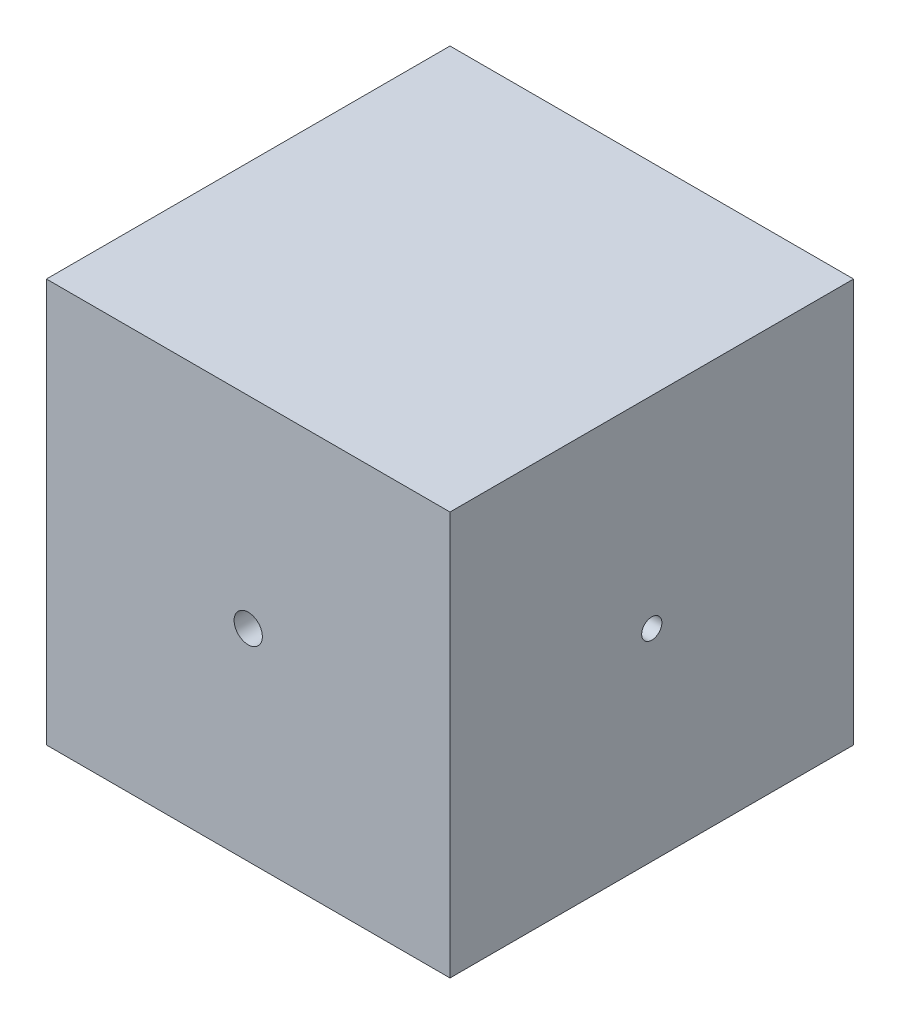
ISO-10303-21;
HEADER;
FILE_DESCRIPTION(('STEP AP214'),'2;1');
FILE_NAME('part.step','',(''),(''),'','','');
FILE_SCHEMA(('AUTOMOTIVE_DESIGN { 1 0 10303 214 1 1 1 1 }'));
ENDSEC;
DATA;
#1=APPLICATION_CONTEXT('core data for automotive mechanical design processes');
#2=APPLICATION_PROTOCOL_DEFINITION('international standard','automotive_design',2000,#1);
#3=PRODUCT_CONTEXT('',#1,'mechanical');
#4=PRODUCT('Part','Part','',(#3));
#5=PRODUCT_RELATED_PRODUCT_CATEGORY('part','',(#4));
#6=PRODUCT_DEFINITION_FORMATION('','',#4);
#7=PRODUCT_DEFINITION_CONTEXT('part definition',#1,'design');
#8=PRODUCT_DEFINITION('design','',#6,#7);
#9=PRODUCT_DEFINITION_SHAPE('','',#8);
#10=(LENGTH_UNIT() NAMED_UNIT(*) SI_UNIT(.MILLI.,.METRE.));
#11=(NAMED_UNIT(*) PLANE_ANGLE_UNIT() SI_UNIT($,.RADIAN.));
#12=(NAMED_UNIT(*) SI_UNIT($,.STERADIAN.) SOLID_ANGLE_UNIT());
#13=UNCERTAINTY_MEASURE_WITH_UNIT(LENGTH_MEASURE(1.E-05),#10,'distance_accuracy_value','');
#14=(GEOMETRIC_REPRESENTATION_CONTEXT(3) GLOBAL_UNCERTAINTY_ASSIGNED_CONTEXT((#13)) GLOBAL_UNIT_ASSIGNED_CONTEXT((#10,
#11,#12)) REPRESENTATION_CONTEXT('',''));
#15=CARTESIAN_POINT('',(0.,0.,0.));
#16=DIRECTION('',(0.,0.,1.));
#17=DIRECTION('',(1.,0.,0.));
#18=AXIS2_PLACEMENT_3D('',#15,#16,#17);
#19=CARTESIAN_POINT('',(50.,50.,50.));
#20=DIRECTION('',(-1.,0.,0.));
#21=DIRECTION('',(0.,-1.,0.));
#22=AXIS2_PLACEMENT_3D('',#19,#20,#21);
#23=PLANE('',#22);
#24=CARTESIAN_POINT('',(50.,0.,0.));
#25=DIRECTION('',(1.,0.,0.));
#26=DIRECTION('',(0.,0.,-1.));
#27=AXIS2_PLACEMENT_3D('',#24,#25,#26);
#28=CIRCLE('',#27,2.5);
#29=CARTESIAN_POINT('',(50.,0.,-2.5));
#30=VERTEX_POINT('',#29);
#31=EDGE_CURVE('E106',#30,#30,#28,.T.);
#32=ORIENTED_EDGE('',*,*,#31,.F.);
#33=EDGE_LOOP('',(#32));
#34=FACE_BOUND('',#33,.T.);
#35=DIRECTION('',(0.,1.,0.));
#36=VECTOR('',#35,1.);
#37=CARTESIAN_POINT('',(50.,50.,-50.));
#38=LINE('',#37,#36);
#39=CARTESIAN_POINT('',(50.,-50.,-50.));
#40=VERTEX_POINT('',#39);
#41=CARTESIAN_POINT('',(50.,50.,-50.));
#42=VERTEX_POINT('',#41);
#43=EDGE_CURVE('E131',#40,#42,#38,.T.);
#44=ORIENTED_EDGE('',*,*,#43,.T.);
#45=DIRECTION('',(0.,0.,-1.));
#46=VECTOR('',#45,1.);
#47=CARTESIAN_POINT('',(50.,50.,50.));
#48=LINE('',#47,#46);
#49=CARTESIAN_POINT('',(50.,50.,50.));
#50=VERTEX_POINT('',#49);
#51=EDGE_CURVE('E11',#50,#42,#48,.T.);
#52=ORIENTED_EDGE('',*,*,#51,.F.);
#53=DIRECTION('',(0.,1.,0.));
#54=VECTOR('',#53,1.);
#55=CARTESIAN_POINT('',(50.,50.,50.));
#56=LINE('',#55,#54);
#57=CARTESIAN_POINT('',(50.,-50.,50.));
#58=VERTEX_POINT('',#57);
#59=EDGE_CURVE('E132',#58,#50,#56,.T.);
#60=ORIENTED_EDGE('',*,*,#59,.F.);
#61=DIRECTION('',(0.,0.,-1.));
#62=VECTOR('',#61,1.);
#63=CARTESIAN_POINT('',(50.,-50.,50.));
#64=LINE('',#63,#62);
#65=EDGE_CURVE('E138',#58,#40,#64,.T.);
#66=ORIENTED_EDGE('',*,*,#65,.T.);
#67=EDGE_LOOP('',(#44,#52,#60,#66));
#68=FACE_BOUND('',#67,.T.);
#69=ADVANCED_FACE('F36',(#34,#68),#23,.F.);
#70=CARTESIAN_POINT('',(-50.,50.,50.));
#71=DIRECTION('',(0.,-1.,0.));
#72=DIRECTION('',(0.,0.,-1.));
#73=AXIS2_PLACEMENT_3D('',#70,#71,#72);
#74=PLANE('',#73);
#75=DIRECTION('',(-1.,0.,0.));
#76=VECTOR('',#75,1.);
#77=CARTESIAN_POINT('',(-50.,50.,-50.));
#78=LINE('',#77,#76);
#79=CARTESIAN_POINT('',(-50.,50.,-50.));
#80=VERTEX_POINT('',#79);
#81=EDGE_CURVE('E141',#42,#80,#78,.T.);
#82=ORIENTED_EDGE('',*,*,#81,.T.);
#83=DIRECTION('',(0.,0.,-1.));
#84=VECTOR('',#83,1.);
#85=CARTESIAN_POINT('',(-50.,50.,50.));
#86=LINE('',#85,#84);
#87=CARTESIAN_POINT('',(-50.,50.,50.));
#88=VERTEX_POINT('',#87);
#89=EDGE_CURVE('E44',#88,#80,#86,.T.);
#90=ORIENTED_EDGE('',*,*,#89,.F.);
#91=DIRECTION('',(-1.,0.,0.));
#92=VECTOR('',#91,1.);
#93=CARTESIAN_POINT('',(-50.,50.,50.));
#94=LINE('',#93,#92);
#95=EDGE_CURVE('E83',#50,#88,#94,.T.);
#96=ORIENTED_EDGE('',*,*,#95,.F.);
#97=ORIENTED_EDGE('',*,*,#51,.T.);
#98=EDGE_LOOP('',(#82,#90,#96,#97));
#99=FACE_BOUND('',#98,.T.);
#100=ADVANCED_FACE('F165',(#99),#74,.F.);
#101=CARTESIAN_POINT('',(-50.,50.,50.));
#102=DIRECTION('',(1.,0.,0.));
#103=DIRECTION('',(0.,1.,0.));
#104=AXIS2_PLACEMENT_3D('',#101,#102,#103);
#105=PLANE('',#104);
#106=CARTESIAN_POINT('',(-50.,0.,0.));
#107=DIRECTION('',(-1.,0.,0.));
#108=DIRECTION('',(0.,0.,1.));
#109=AXIS2_PLACEMENT_3D('',#106,#107,#108);
#110=CIRCLE('',#109,3.39999999999999);
#111=CARTESIAN_POINT('',(-50.,0.,3.39999999999999));
#112=VERTEX_POINT('',#111);
#113=EDGE_CURVE('E125',#112,#112,#110,.T.);
#114=ORIENTED_EDGE('',*,*,#113,.F.);
#115=EDGE_LOOP('',(#114));
#116=FACE_BOUND('',#115,.T.);
#117=DIRECTION('',(0.,-1.,0.));
#118=VECTOR('',#117,1.);
#119=CARTESIAN_POINT('',(-50.,50.,-50.));
#120=LINE('',#119,#118);
#121=CARTESIAN_POINT('',(-50.,-50.,-50.));
#122=VERTEX_POINT('',#121);
#123=EDGE_CURVE('E70',#80,#122,#120,.T.);
#124=ORIENTED_EDGE('',*,*,#123,.T.);
#125=DIRECTION('',(0.,0.,-1.));
#126=VECTOR('',#125,1.);
#127=CARTESIAN_POINT('',(-50.,-50.,50.));
#128=LINE('',#127,#126);
#129=CARTESIAN_POINT('',(-50.,-50.,50.));
#130=VERTEX_POINT('',#129);
#131=EDGE_CURVE('E146',#130,#122,#128,.T.);
#132=ORIENTED_EDGE('',*,*,#131,.F.);
#133=DIRECTION('',(0.,-1.,0.));
#134=VECTOR('',#133,1.);
#135=CARTESIAN_POINT('',(-50.,50.,50.));
#136=LINE('',#135,#134);
#137=EDGE_CURVE('E135',#88,#130,#136,.T.);
#138=ORIENTED_EDGE('',*,*,#137,.F.);
#139=ORIENTED_EDGE('',*,*,#89,.T.);
#140=EDGE_LOOP('',(#124,#132,#138,#139));
#141=FACE_BOUND('',#140,.T.);
#142=ADVANCED_FACE('F148',(#116,#141),#105,.F.);
#143=CARTESIAN_POINT('',(-50.,-50.,50.));
#144=DIRECTION('',(0.,1.,0.));
#145=DIRECTION('',(0.,0.,1.));
#146=AXIS2_PLACEMENT_3D('',#143,#144,#145);
#147=PLANE('',#146);
#148=DIRECTION('',(1.,0.,0.));
#149=VECTOR('',#148,1.);
#150=CARTESIAN_POINT('',(-50.,-50.,-50.));
#151=LINE('',#150,#149);
#152=EDGE_CURVE('E76',#122,#40,#151,.T.);
#153=ORIENTED_EDGE('',*,*,#152,.T.);
#154=ORIENTED_EDGE('',*,*,#65,.F.);
#155=DIRECTION('',(1.,0.,0.));
#156=VECTOR('',#155,1.);
#157=CARTESIAN_POINT('',(-50.,-50.,50.));
#158=LINE('',#157,#156);
#159=EDGE_CURVE('E52',#130,#58,#158,.T.);
#160=ORIENTED_EDGE('',*,*,#159,.F.);
#161=ORIENTED_EDGE('',*,*,#131,.T.);
#162=EDGE_LOOP('',(#153,#154,#160,#161));
#163=FACE_BOUND('',#162,.T.);
#164=ADVANCED_FACE('F155',(#163),#147,.F.);
#165=CARTESIAN_POINT('',(0.,0.,50.));
#166=DIRECTION('',(0.,0.,1.));
#167=DIRECTION('',(1.,0.,0.));
#168=AXIS2_PLACEMENT_3D('',#165,#166,#167);
#169=PLANE('',#168);
#170=CARTESIAN_POINT('',(0.,0.,50.));
#171=DIRECTION('',(0.,0.,1.));
#172=DIRECTION('',(1.,0.,0.));
#173=AXIS2_PLACEMENT_3D('',#170,#171,#172);
#174=CIRCLE('',#173,3.5);
#175=CARTESIAN_POINT('',(3.5,0.,50.));
#176=VERTEX_POINT('',#175);
#177=EDGE_CURVE('E119',#176,#176,#174,.T.);
#178=ORIENTED_EDGE('',*,*,#177,.F.);
#179=EDGE_LOOP('',(#178));
#180=FACE_BOUND('',#179,.T.);
#181=ORIENTED_EDGE('',*,*,#59,.T.);
#182=ORIENTED_EDGE('',*,*,#95,.T.);
#183=ORIENTED_EDGE('',*,*,#137,.T.);
#184=ORIENTED_EDGE('',*,*,#159,.T.);
#185=EDGE_LOOP('',(#181,#182,#183,#184));
#186=FACE_BOUND('',#185,.T.);
#187=ADVANCED_FACE('F157',(#180,#186),#169,.T.);
#188=CARTESIAN_POINT('',(0.,0.,-50.));
#189=DIRECTION('',(0.,0.,1.));
#190=DIRECTION('',(1.,0.,0.));
#191=AXIS2_PLACEMENT_3D('',#188,#189,#190);
#192=PLANE('',#191);
#193=CARTESIAN_POINT('',(0.,0.,-50.));
#194=DIRECTION('',(0.,0.,-1.));
#195=DIRECTION('',(-1.,0.,0.));
#196=AXIS2_PLACEMENT_3D('',#193,#194,#195);
#197=CIRCLE('',#196,10.);
#198=CARTESIAN_POINT('',(-10.,0.,-50.));
#199=VERTEX_POINT('',#198);
#200=EDGE_CURVE('E209',#199,#199,#197,.T.);
#201=ORIENTED_EDGE('',*,*,#200,.F.);
#202=EDGE_LOOP('',(#201));
#203=FACE_BOUND('',#202,.T.);
#204=ORIENTED_EDGE('',*,*,#43,.F.);
#205=ORIENTED_EDGE('',*,*,#152,.F.);
#206=ORIENTED_EDGE('',*,*,#123,.F.);
#207=ORIENTED_EDGE('',*,*,#81,.F.);
#208=EDGE_LOOP('',(#204,#205,#206,#207));
#209=FACE_BOUND('',#208,.T.);
#210=ADVANCED_FACE('F151',(#203,#209),#192,.F.);
#211=CARTESIAN_POINT('',(-22.25,0.,0.));
#212=DIRECTION('',(-1.,0.,0.));
#213=DIRECTION('',(0.,0.,1.));
#214=AXIS2_PLACEMENT_3D('',#211,#212,#213);
#215=CONICAL_SURFACE('',#214,3.39999999999999,1.02974425867665);
#216=CARTESIAN_POINT('',(-20.2070738953063,0.,0.));
#217=VERTEX_POINT('',#216);
#218=VERTEX_LOOP('',#217);
#219=FACE_BOUND('',#218,.T.);
#220=CARTESIAN_POINT('',(-22.25,0.,0.));
#221=DIRECTION('',(-1.,0.,0.));
#222=DIRECTION('',(0.,0.,1.));
#223=AXIS2_PLACEMENT_3D('',#220,#221,#222);
#224=CIRCLE('',#223,3.39999999999999);
#225=CARTESIAN_POINT('',(-22.25,0.,3.39999999999999));
#226=VERTEX_POINT('',#225);
#227=EDGE_CURVE('E128',#226,#226,#224,.T.);
#228=ORIENTED_EDGE('',*,*,#227,.T.);
#229=EDGE_LOOP('',(#228));
#230=FACE_BOUND('',#229,.T.);
#231=ADVANCED_FACE('F199',(#219,#230),#215,.F.);
#232=CARTESIAN_POINT('',(-50.,0.,0.));
#233=DIRECTION('',(-1.,0.,0.));
#234=DIRECTION('',(0.,0.,1.));
#235=AXIS2_PLACEMENT_3D('',#232,#233,#234);
#236=CYLINDRICAL_SURFACE('',#235,3.39999999999999);
#237=ORIENTED_EDGE('',*,*,#227,.F.);
#238=EDGE_LOOP('',(#237));
#239=FACE_BOUND('',#238,.T.);
#240=ORIENTED_EDGE('',*,*,#113,.T.);
#241=EDGE_LOOP('',(#240));
#242=FACE_BOUND('',#241,.T.);
#243=ADVANCED_FACE('F195',(#239,#242),#236,.F.);
#244=CARTESIAN_POINT('',(0.,0.,31.));
#245=DIRECTION('',(0.,0.,1.));
#246=DIRECTION('',(1.,0.,0.));
#247=AXIS2_PLACEMENT_3D('',#244,#245,#246);
#248=CONICAL_SURFACE('',#247,3.49999999999999,1.02974425867665);
#249=CARTESIAN_POINT('',(0.,0.,28.8969878334035));
#250=VERTEX_POINT('',#249);
#251=VERTEX_LOOP('',#250);
#252=FACE_BOUND('',#251,.T.);
#253=CARTESIAN_POINT('',(0.,0.,31.));
#254=DIRECTION('',(0.,0.,1.));
#255=DIRECTION('',(1.,0.,0.));
#256=AXIS2_PLACEMENT_3D('',#253,#254,#255);
#257=CIRCLE('',#256,3.49999999999999);
#258=CARTESIAN_POINT('',(3.49999999999999,0.,31.));
#259=VERTEX_POINT('',#258);
#260=EDGE_CURVE('E122',#259,#259,#257,.T.);
#261=ORIENTED_EDGE('',*,*,#260,.T.);
#262=EDGE_LOOP('',(#261));
#263=FACE_BOUND('',#262,.T.);
#264=ADVANCED_FACE('F191',(#252,#263),#248,.F.);
#265=CARTESIAN_POINT('',(0.,0.,50.));
#266=DIRECTION('',(0.,0.,1.));
#267=DIRECTION('',(1.,0.,0.));
#268=AXIS2_PLACEMENT_3D('',#265,#266,#267);
#269=CYLINDRICAL_SURFACE('',#268,3.5);
#270=ORIENTED_EDGE('',*,*,#260,.F.);
#271=EDGE_LOOP('',(#270));
#272=FACE_BOUND('',#271,.T.);
#273=ORIENTED_EDGE('',*,*,#177,.T.);
#274=EDGE_LOOP('',(#273));
#275=FACE_BOUND('',#274,.T.);
#276=ADVANCED_FACE('F183',(#272,#275),#269,.F.);
#277=CARTESIAN_POINT('',(35.,0.,0.));
#278=DIRECTION('',(1.,0.,0.));
#279=DIRECTION('',(0.,0.,-1.));
#280=AXIS2_PLACEMENT_3D('',#277,#278,#279);
#281=CONICAL_SURFACE('',#280,2.5,1.02974425867665);
#282=CARTESIAN_POINT('',(33.4978484524311,0.,0.));
#283=VERTEX_POINT('',#282);
#284=VERTEX_LOOP('',#283);
#285=FACE_BOUND('',#284,.T.);
#286=CARTESIAN_POINT('',(35.,0.,0.));
#287=DIRECTION('',(1.,0.,0.));
#288=DIRECTION('',(0.,0.,-1.));
#289=AXIS2_PLACEMENT_3D('',#286,#287,#288);
#290=CIRCLE('',#289,2.5);
#291=CARTESIAN_POINT('',(35.,0.,-2.5));
#292=VERTEX_POINT('',#291);
#293=EDGE_CURVE('E110',#292,#292,#290,.T.);
#294=ORIENTED_EDGE('',*,*,#293,.T.);
#295=EDGE_LOOP('',(#294));
#296=FACE_BOUND('',#295,.T.);
#297=ADVANCED_FACE('F177',(#285,#296),#281,.F.);
#298=CARTESIAN_POINT('',(50.,0.,0.));
#299=DIRECTION('',(1.,0.,0.));
#300=DIRECTION('',(0.,0.,-1.));
#301=AXIS2_PLACEMENT_3D('',#298,#299,#300);
#302=CYLINDRICAL_SURFACE('',#301,2.5);
#303=ORIENTED_EDGE('',*,*,#293,.F.);
#304=EDGE_LOOP('',(#303));
#305=FACE_BOUND('',#304,.T.);
#306=ORIENTED_EDGE('',*,*,#31,.T.);
#307=EDGE_LOOP('',(#306));
#308=FACE_BOUND('',#307,.T.);
#309=ADVANCED_FACE('F100',(#305,#308),#302,.F.);
#310=CARTESIAN_POINT('',(0.,0.,-15.));
#311=DIRECTION('',(0.,0.,-1.));
#312=DIRECTION('',(-1.,0.,0.));
#313=AXIS2_PLACEMENT_3D('',#310,#311,#312);
#314=CONICAL_SURFACE('',#313,6.74999999999999,1.02974425867665);
#315=CARTESIAN_POINT('',(0.,0.,-10.944190821564));
#316=VERTEX_POINT('',#315);
#317=VERTEX_LOOP('',#316);
#318=FACE_BOUND('',#317,.T.);
#319=CARTESIAN_POINT('',(0.,0.,-15.));
#320=DIRECTION('',(0.,0.,-1.));
#321=DIRECTION('',(-1.,0.,0.));
#322=AXIS2_PLACEMENT_3D('',#319,#320,#321);
#323=CIRCLE('',#322,6.74999999999999);
#324=CARTESIAN_POINT('',(-6.74999999999999,0.,-15.));
#325=VERTEX_POINT('',#324);
#326=EDGE_CURVE('E104',#325,#325,#323,.T.);
#327=ORIENTED_EDGE('',*,*,#326,.T.);
#328=EDGE_LOOP('',(#327));
#329=FACE_BOUND('',#328,.T.);
#330=ADVANCED_FACE('F96',(#318,#329),#314,.F.);
#331=CARTESIAN_POINT('',(0.,0.,-50.));
#332=DIRECTION('',(0.,0.,-1.));
#333=DIRECTION('',(-1.,0.,0.));
#334=AXIS2_PLACEMENT_3D('',#331,#332,#333);
#335=CYLINDRICAL_SURFACE('',#334,6.74999999999999);
#336=ORIENTED_EDGE('',*,*,#326,.F.);
#337=EDGE_LOOP('',(#336));
#338=FACE_BOUND('',#337,.T.);
#339=CARTESIAN_POINT('',(0.,0.,-38.));
#340=DIRECTION('',(0.,0.,-1.));
#341=DIRECTION('',(-1.,0.,0.));
#342=AXIS2_PLACEMENT_3D('',#339,#340,#341);
#343=CIRCLE('',#342,6.75);
#344=CARTESIAN_POINT('',(-6.75,0.,-38.));
#345=VERTEX_POINT('',#344);
#346=EDGE_CURVE('E107',#345,#345,#343,.T.);
#347=ORIENTED_EDGE('',*,*,#346,.T.);
#348=EDGE_LOOP('',(#347));
#349=FACE_BOUND('',#348,.T.);
#350=ADVANCED_FACE('F99',(#338,#349),#335,.F.);
#351=CARTESIAN_POINT('',(6.75,0.,-38.));
#352=DIRECTION('',(0.,0.,1.));
#353=DIRECTION('',(1.,0.,0.));
#354=AXIS2_PLACEMENT_3D('',#351,#352,#353);
#355=PLANE('',#354);
#356=ORIENTED_EDGE('',*,*,#346,.F.);
#357=EDGE_LOOP('',(#356));
#358=FACE_BOUND('',#357,.T.);
#359=CARTESIAN_POINT('',(0.,0.,-38.));
#360=DIRECTION('',(0.,0.,-1.));
#361=DIRECTION('',(-1.,0.,0.));
#362=AXIS2_PLACEMENT_3D('',#359,#360,#361);
#363=CIRCLE('',#362,10.);
#364=CARTESIAN_POINT('',(-10.,0.,-38.));
#365=VERTEX_POINT('',#364);
#366=EDGE_CURVE('E113',#365,#365,#363,.T.);
#367=ORIENTED_EDGE('',*,*,#366,.T.);
#368=EDGE_LOOP('',(#367));
#369=FACE_BOUND('',#368,.T.);
#370=ADVANCED_FACE('F215',(#358,#369),#355,.F.);
#371=CARTESIAN_POINT('',(0.,0.,-50.));
#372=DIRECTION('',(0.,0.,-1.));
#373=DIRECTION('',(-1.,0.,0.));
#374=AXIS2_PLACEMENT_3D('',#371,#372,#373);
#375=CYLINDRICAL_SURFACE('',#374,10.);
#376=ORIENTED_EDGE('',*,*,#366,.F.);
#377=EDGE_LOOP('',(#376));
#378=FACE_BOUND('',#377,.T.);
#379=ORIENTED_EDGE('',*,*,#200,.T.);
#380=EDGE_LOOP('',(#379));
#381=FACE_BOUND('',#380,.T.);
#382=ADVANCED_FACE('F217',(#378,#381),#375,.F.);
#383=CLOSED_SHELL('',(#69,#100,#142,#164,#187,#210,#231,#243,#264,#276,#297,#309,#330,#350,#370,#382));
#384=MANIFOLD_SOLID_BREP('B2',#383);
#385=ADVANCED_BREP_SHAPE_REPRESENTATION('',(#18,#384),#14);
#386=SHAPE_DEFINITION_REPRESENTATION(#9,#385);
ENDSEC;
END-ISO-10303-21;
